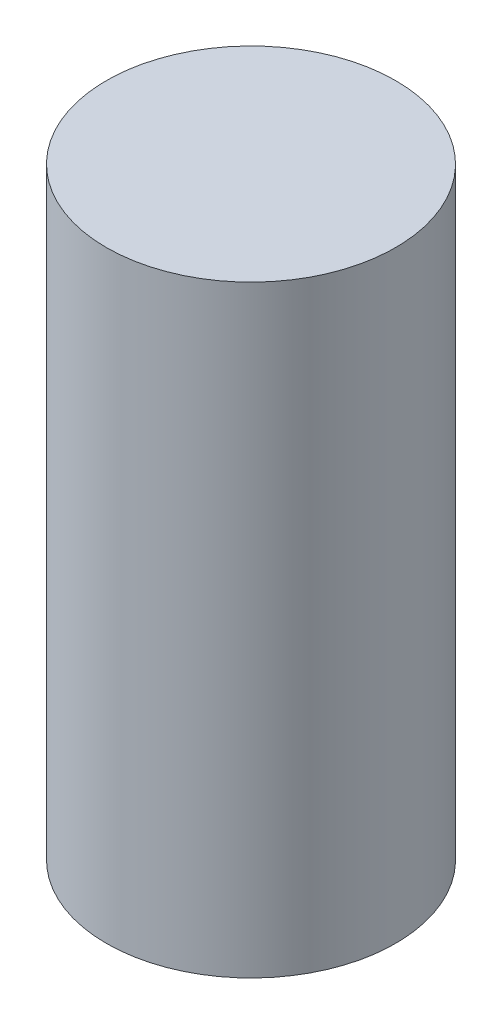
ISO-10303-21;
HEADER;
FILE_DESCRIPTION(('STEP AP214'),'2;1');
FILE_NAME('part.step','',(''),(''),'','','');
FILE_SCHEMA(('AUTOMOTIVE_DESIGN { 1 0 10303 214 1 1 1 1 }'));
ENDSEC;
DATA;
#1=APPLICATION_CONTEXT('core data for automotive mechanical design processes');
#2=APPLICATION_PROTOCOL_DEFINITION('international standard','automotive_design',2000,#1);
#3=PRODUCT_CONTEXT('',#1,'mechanical');
#4=PRODUCT('Part','Part','',(#3));
#5=PRODUCT_RELATED_PRODUCT_CATEGORY('part','',(#4));
#6=PRODUCT_DEFINITION_FORMATION('','',#4);
#7=PRODUCT_DEFINITION_CONTEXT('part definition',#1,'design');
#8=PRODUCT_DEFINITION('design','',#6,#7);
#9=PRODUCT_DEFINITION_SHAPE('','',#8);
#10=(LENGTH_UNIT() NAMED_UNIT(*) SI_UNIT(.MILLI.,.METRE.));
#11=(NAMED_UNIT(*) PLANE_ANGLE_UNIT() SI_UNIT($,.RADIAN.));
#12=(NAMED_UNIT(*) SI_UNIT($,.STERADIAN.) SOLID_ANGLE_UNIT());
#13=UNCERTAINTY_MEASURE_WITH_UNIT(LENGTH_MEASURE(1.E-05),#10,'distance_accuracy_value','');
#14=(GEOMETRIC_REPRESENTATION_CONTEXT(3) GLOBAL_UNCERTAINTY_ASSIGNED_CONTEXT((#13)) GLOBAL_UNIT_ASSIGNED_CONTEXT((#10,
#11,#12)) REPRESENTATION_CONTEXT('',''));
#15=CARTESIAN_POINT('',(0.,0.,0.));
#16=DIRECTION('',(0.,0.,1.));
#17=DIRECTION('',(1.,0.,0.));
#18=AXIS2_PLACEMENT_3D('',#15,#16,#17);
#19=CARTESIAN_POINT('',(0.,2.5,0.));
#20=DIRECTION('',(0.,-1.,0.));
#21=DIRECTION('',(0.,0.,-1.));
#22=AXIS2_PLACEMENT_3D('',#19,#20,#21);
#23=CYLINDRICAL_SURFACE('',#22,0.6);
#24=CARTESIAN_POINT('',(0.,2.5,0.));
#25=DIRECTION('',(0.,1.,0.));
#26=DIRECTION('',(0.,0.,1.));
#27=AXIS2_PLACEMENT_3D('',#24,#25,#26);
#28=CIRCLE('',#27,0.6);
#29=CARTESIAN_POINT('',(0.,2.5,0.6));
#30=VERTEX_POINT('',#29);
#31=EDGE_CURVE('E10',#30,#30,#28,.T.);
#32=ORIENTED_EDGE('',*,*,#31,.F.);
#33=EDGE_LOOP('',(#32));
#34=FACE_BOUND('',#33,.T.);
#35=CARTESIAN_POINT('',(0.,0.,0.));
#36=DIRECTION('',(0.,1.,0.));
#37=DIRECTION('',(0.,0.,1.));
#38=AXIS2_PLACEMENT_3D('',#35,#36,#37);
#39=CIRCLE('',#38,0.6);
#40=CARTESIAN_POINT('',(0.,0.,0.6));
#41=VERTEX_POINT('',#40);
#42=EDGE_CURVE('E46',#41,#41,#39,.T.);
#43=ORIENTED_EDGE('',*,*,#42,.T.);
#44=EDGE_LOOP('',(#43));
#45=FACE_BOUND('',#44,.T.);
#46=ADVANCED_FACE('F43',(#34,#45),#23,.T.);
#47=CARTESIAN_POINT('',(0.,2.5,0.));
#48=DIRECTION('',(0.,1.,0.));
#49=DIRECTION('',(0.,0.,1.));
#50=AXIS2_PLACEMENT_3D('',#47,#48,#49);
#51=PLANE('',#50);
#52=ORIENTED_EDGE('',*,*,#31,.T.);
#53=EDGE_LOOP('',(#52));
#54=FACE_BOUND('',#53,.T.);
#55=ADVANCED_FACE('F60',(#54),#51,.T.);
#56=CARTESIAN_POINT('',(0.,0.,0.));
#57=DIRECTION('',(0.,1.,0.));
#58=DIRECTION('',(0.,0.,1.));
#59=AXIS2_PLACEMENT_3D('',#56,#57,#58);
#60=PLANE('',#59);
#61=ORIENTED_EDGE('',*,*,#42,.F.);
#62=EDGE_LOOP('',(#61));
#63=FACE_BOUND('',#62,.T.);
#64=ADVANCED_FACE('F58',(#63),#60,.F.);
#65=CLOSED_SHELL('',(#46,#55,#64));
#66=MANIFOLD_SOLID_BREP('B2',#65);
#67=ADVANCED_BREP_SHAPE_REPRESENTATION('',(#18,#66),#14);
#68=SHAPE_DEFINITION_REPRESENTATION(#9,#67);
ENDSEC;
END-ISO-10303-21;
